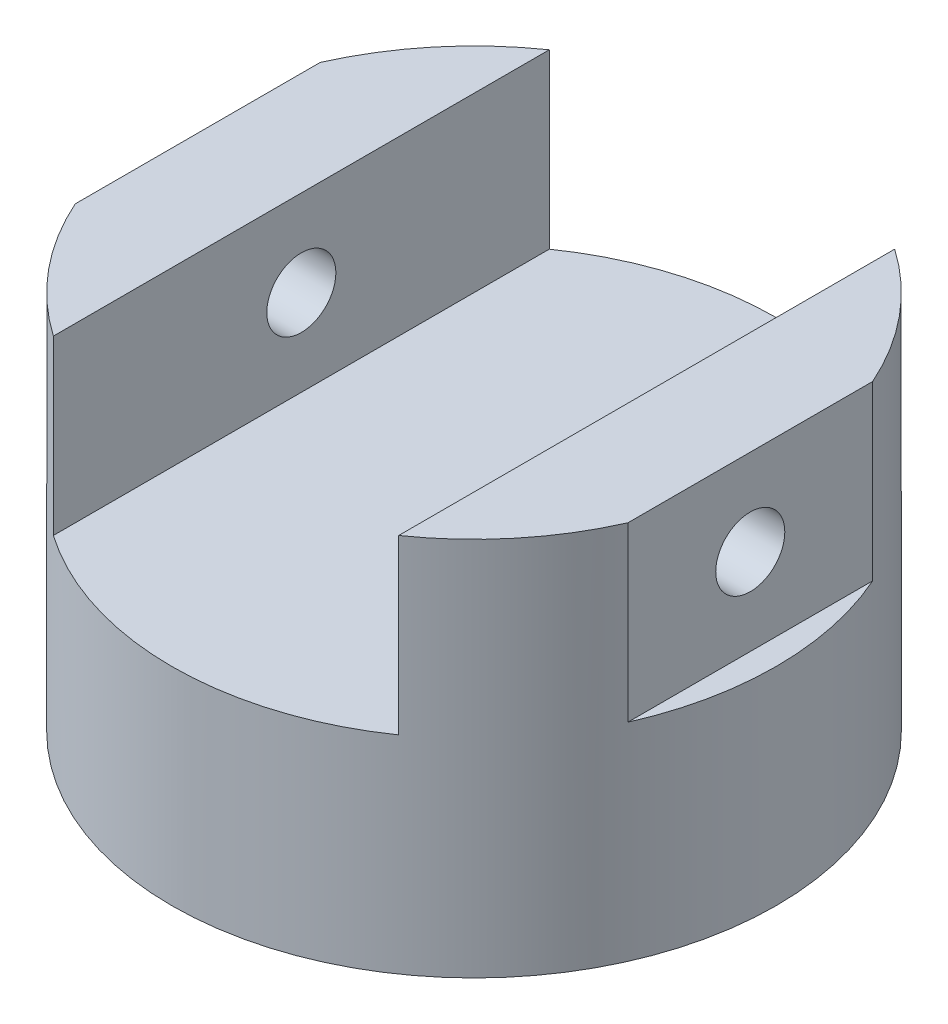
ISO-10303-21;
HEADER;
FILE_DESCRIPTION(('STEP AP214'),'2;1');
FILE_NAME('part.step','',(''),(''),'','','');
FILE_SCHEMA(('AUTOMOTIVE_DESIGN { 1 0 10303 214 1 1 1 1 }'));
ENDSEC;
DATA;
#1=APPLICATION_CONTEXT('core data for automotive mechanical design processes');
#2=APPLICATION_PROTOCOL_DEFINITION('international standard','automotive_design',2000,#1);
#3=PRODUCT_CONTEXT('',#1,'mechanical');
#4=PRODUCT('Part','Part','',(#3));
#5=PRODUCT_RELATED_PRODUCT_CATEGORY('part','',(#4));
#6=PRODUCT_DEFINITION_FORMATION('','',#4);
#7=PRODUCT_DEFINITION_CONTEXT('part definition',#1,'design');
#8=PRODUCT_DEFINITION('design','',#6,#7);
#9=PRODUCT_DEFINITION_SHAPE('','',#8);
#10=(LENGTH_UNIT() NAMED_UNIT(*) SI_UNIT(.MILLI.,.METRE.));
#11=(NAMED_UNIT(*) PLANE_ANGLE_UNIT() SI_UNIT($,.RADIAN.));
#12=(NAMED_UNIT(*) SI_UNIT($,.STERADIAN.) SOLID_ANGLE_UNIT());
#13=UNCERTAINTY_MEASURE_WITH_UNIT(LENGTH_MEASURE(1.E-05),#10,'distance_accuracy_value','');
#14=(GEOMETRIC_REPRESENTATION_CONTEXT(3) GLOBAL_UNCERTAINTY_ASSIGNED_CONTEXT((#13)) GLOBAL_UNIT_ASSIGNED_CONTEXT((#10,
#11,#12)) REPRESENTATION_CONTEXT('',''));
#15=CARTESIAN_POINT('',(0.,0.,0.));
#16=DIRECTION('',(0.,0.,1.));
#17=DIRECTION('',(1.,0.,0.));
#18=AXIS2_PLACEMENT_3D('',#15,#16,#17);
#19=CARTESIAN_POINT('',(0.,260.,0.));
#20=DIRECTION('',(0.,1.,0.));
#21=DIRECTION('',(0.,0.,1.));
#22=AXIS2_PLACEMENT_3D('',#19,#20,#21);
#23=PLANE('',#22);
#24=DIRECTION('',(0.,0.,1.));
#25=VECTOR('',#24,1.);
#26=CARTESIAN_POINT('',(160.,260.,-175.));
#27=LINE('',#26,#25);
#28=CARTESIAN_POINT('',(160.,260.,-70.887234393789));
#29=VERTEX_POINT('',#28);
#30=CARTESIAN_POINT('',(160.,260.,70.887234393789));
#31=VERTEX_POINT('',#30);
#32=EDGE_CURVE('E51',#29,#31,#27,.T.);
#33=ORIENTED_EDGE('',*,*,#32,.F.);
#34=CARTESIAN_POINT('',(0.,260.,0.));
#35=DIRECTION('',(0.,-1.,0.));
#36=DIRECTION('',(0.,0.,-1.));
#37=AXIS2_PLACEMENT_3D('',#34,#35,#36);
#38=CIRCLE('',#37,175.);
#39=CARTESIAN_POINT('',(100.,260.,-143.614066163451));
#40=VERTEX_POINT('',#39);
#41=EDGE_CURVE('E154',#40,#29,#38,.T.);
#42=ORIENTED_EDGE('',*,*,#41,.F.);
#43=DIRECTION('',(0.,0.,1.));
#44=VECTOR('',#43,1.);
#45=CARTESIAN_POINT('',(100.,260.,-175.));
#46=LINE('',#45,#44);
#47=CARTESIAN_POINT('',(100.,260.,143.614066163451));
#48=VERTEX_POINT('',#47);
#49=EDGE_CURVE('E131',#40,#48,#46,.T.);
#50=ORIENTED_EDGE('',*,*,#49,.T.);
#51=EDGE_CURVE('E153',#31,#48,#38,.T.);
#52=ORIENTED_EDGE('',*,*,#51,.F.);
#53=EDGE_LOOP('',(#33,#42,#50,#52));
#54=FACE_BOUND('',#53,.T.);
#55=ADVANCED_FACE('F35',(#54),#23,.T.);
#56=DIRECTION('',(0.,0.,1.));
#57=VECTOR('',#56,1.);
#58=CARTESIAN_POINT('',(-160.,260.,-175.));
#59=LINE('',#58,#57);
#60=CARTESIAN_POINT('',(-160.,260.,-70.887234393789));
#61=VERTEX_POINT('',#60);
#62=CARTESIAN_POINT('',(-160.,260.,70.887234393789));
#63=VERTEX_POINT('',#62);
#64=EDGE_CURVE('E117',#61,#63,#59,.T.);
#65=ORIENTED_EDGE('',*,*,#64,.T.);
#66=CARTESIAN_POINT('',(-100.,260.,143.614066163451));
#67=VERTEX_POINT('',#66);
#68=EDGE_CURVE('E151',#67,#63,#38,.T.);
#69=ORIENTED_EDGE('',*,*,#68,.F.);
#70=DIRECTION('',(0.,0.,1.));
#71=VECTOR('',#70,1.);
#72=CARTESIAN_POINT('',(-100.,260.,-175.));
#73=LINE('',#72,#71);
#74=CARTESIAN_POINT('',(-100.,260.,-143.614066163451));
#75=VERTEX_POINT('',#74);
#76=EDGE_CURVE('E59',#75,#67,#73,.T.);
#77=ORIENTED_EDGE('',*,*,#76,.F.);
#78=EDGE_CURVE('E150',#61,#75,#38,.T.);
#79=ORIENTED_EDGE('',*,*,#78,.F.);
#80=EDGE_LOOP('',(#65,#69,#77,#79));
#81=FACE_BOUND('',#80,.T.);
#82=ADVANCED_FACE('F37',(#81),#23,.T.);
#83=CARTESIAN_POINT('',(0.,0.,0.));
#84=DIRECTION('',(0.,-1.,0.));
#85=DIRECTION('',(0.,0.,-1.));
#86=AXIS2_PLACEMENT_3D('',#83,#84,#85);
#87=CYLINDRICAL_SURFACE('',#86,175.);
#88=DIRECTION('',(0.,-1.,0.));
#89=VECTOR('',#88,1.);
#90=CARTESIAN_POINT('',(-160.,0.,70.887234393789));
#91=LINE('',#90,#89);
#92=CARTESIAN_POINT('',(-160.,160.,70.8872343937892));
#93=VERTEX_POINT('',#92);
#94=EDGE_CURVE('E11',#93,#63,#91,.F.);
#95=ORIENTED_EDGE('',*,*,#94,.F.);
#96=CARTESIAN_POINT('',(0.,160.,0.));
#97=DIRECTION('',(0.,-1.,0.));
#98=DIRECTION('',(0.,0.,-1.));
#99=AXIS2_PLACEMENT_3D('',#96,#97,#98);
#100=CIRCLE('',#99,175.);
#101=CARTESIAN_POINT('',(-160.,160.,-70.8872343937892));
#102=VERTEX_POINT('',#101);
#103=EDGE_CURVE('E102',#102,#93,#100,.F.);
#104=ORIENTED_EDGE('',*,*,#103,.F.);
#105=DIRECTION('',(0.,-1.,0.));
#106=VECTOR('',#105,1.);
#107=CARTESIAN_POINT('',(-160.,0.,-70.887234393789));
#108=LINE('',#107,#106);
#109=EDGE_CURVE('E44',#61,#102,#108,.T.);
#110=ORIENTED_EDGE('',*,*,#109,.F.);
#111=ORIENTED_EDGE('',*,*,#78,.T.);
#112=DIRECTION('',(0.,-1.,0.));
#113=VECTOR('',#112,1.);
#114=CARTESIAN_POINT('',(-100.,0.,-143.614066163451));
#115=LINE('',#114,#113);
#116=CARTESIAN_POINT('',(-100.,160.,-143.614066163451));
#117=VERTEX_POINT('',#116);
#118=EDGE_CURVE('E165',#117,#75,#115,.F.);
#119=ORIENTED_EDGE('',*,*,#118,.F.);
#120=CARTESIAN_POINT('',(0.,160.,0.));
#121=DIRECTION('',(0.,-1.,0.));
#122=DIRECTION('',(0.,0.,-1.));
#123=AXIS2_PLACEMENT_3D('',#120,#121,#122);
#124=CIRCLE('',#123,175.);
#125=CARTESIAN_POINT('',(100.,160.,-143.614066163451));
#126=VERTEX_POINT('',#125);
#127=EDGE_CURVE('E158',#126,#117,#124,.F.);
#128=ORIENTED_EDGE('',*,*,#127,.F.);
#129=DIRECTION('',(0.,-1.,0.));
#130=VECTOR('',#129,1.);
#131=CARTESIAN_POINT('',(100.,0.,-143.614066163451));
#132=LINE('',#131,#130);
#133=EDGE_CURVE('E161',#40,#126,#132,.T.);
#134=ORIENTED_EDGE('',*,*,#133,.F.);
#135=ORIENTED_EDGE('',*,*,#41,.T.);
#136=DIRECTION('',(0.,-1.,0.));
#137=VECTOR('',#136,1.);
#138=CARTESIAN_POINT('',(160.,0.,-70.887234393789));
#139=LINE('',#138,#137);
#140=CARTESIAN_POINT('',(160.,160.,-70.887234393789));
#141=VERTEX_POINT('',#140);
#142=EDGE_CURVE('E111',#141,#29,#139,.F.);
#143=ORIENTED_EDGE('',*,*,#142,.F.);
#144=CARTESIAN_POINT('',(0.,160.,0.));
#145=DIRECTION('',(0.,-1.,0.));
#146=DIRECTION('',(0.,0.,-1.));
#147=AXIS2_PLACEMENT_3D('',#144,#145,#146);
#148=CIRCLE('',#147,175.);
#149=CARTESIAN_POINT('',(160.,160.,70.887234393789));
#150=VERTEX_POINT('',#149);
#151=EDGE_CURVE('E169',#150,#141,#148,.F.);
#152=ORIENTED_EDGE('',*,*,#151,.F.);
#153=DIRECTION('',(0.,-1.,0.));
#154=VECTOR('',#153,1.);
#155=CARTESIAN_POINT('',(160.,0.,70.887234393789));
#156=LINE('',#155,#154);
#157=EDGE_CURVE('E167',#31,#150,#156,.T.);
#158=ORIENTED_EDGE('',*,*,#157,.F.);
#159=ORIENTED_EDGE('',*,*,#51,.T.);
#160=DIRECTION('',(0.,-1.,0.));
#161=VECTOR('',#160,1.);
#162=CARTESIAN_POINT('',(100.,0.,143.614066163451));
#163=LINE('',#162,#161);
#164=CARTESIAN_POINT('',(100.,160.,143.614066163451));
#165=VERTEX_POINT('',#164);
#166=EDGE_CURVE('E157',#165,#48,#163,.F.);
#167=ORIENTED_EDGE('',*,*,#166,.F.);
#168=CARTESIAN_POINT('',(-100.,160.,143.614066163451));
#169=VERTEX_POINT('',#168);
#170=EDGE_CURVE('E155',#169,#165,#124,.F.);
#171=ORIENTED_EDGE('',*,*,#170,.F.);
#172=DIRECTION('',(0.,-1.,0.));
#173=VECTOR('',#172,1.);
#174=CARTESIAN_POINT('',(-100.,0.,143.614066163451));
#175=LINE('',#174,#173);
#176=EDGE_CURVE('E163',#67,#169,#175,.T.);
#177=ORIENTED_EDGE('',*,*,#176,.F.);
#178=ORIENTED_EDGE('',*,*,#68,.T.);
#179=EDGE_LOOP('',(#95,#104,#110,#111,#119,#128,#134,#135,#143,#152,#158,#159,#167,#171,#177,#178));
#180=FACE_BOUND('',#179,.T.);
#181=CARTESIAN_POINT('',(0.,40.,0.));
#182=DIRECTION('',(0.,-1.,0.));
#183=DIRECTION('',(0.,0.,-1.));
#184=AXIS2_PLACEMENT_3D('',#181,#182,#183);
#185=CIRCLE('',#184,175.);
#186=CARTESIAN_POINT('',(0.,40.,-175.));
#187=VERTEX_POINT('',#186);
#188=EDGE_CURVE('E147',#187,#187,#185,.T.);
#189=ORIENTED_EDGE('',*,*,#188,.F.);
#190=EDGE_LOOP('',(#189));
#191=FACE_BOUND('',#190,.T.);
#192=ADVANCED_FACE('F104',(#180,#191),#87,.T.);
#193=CARTESIAN_POINT('',(175.,40.,0.));
#194=DIRECTION('',(0.,-1.,0.));
#195=DIRECTION('',(0.,0.,-1.));
#196=AXIS2_PLACEMENT_3D('',#193,#194,#195);
#197=PLANE('',#196);
#198=ORIENTED_EDGE('',*,*,#188,.T.);
#199=EDGE_LOOP('',(#198));
#200=FACE_BOUND('',#199,.T.);
#201=CARTESIAN_POINT('',(0.,40.,0.));
#202=DIRECTION('',(0.,-1.,0.));
#203=DIRECTION('',(0.,0.,-1.));
#204=AXIS2_PLACEMENT_3D('',#201,#202,#203);
#205=CIRCLE('',#204,75.);
#206=CARTESIAN_POINT('',(0.,40.,-75.));
#207=VERTEX_POINT('',#206);
#208=EDGE_CURVE('E144',#207,#207,#205,.T.);
#209=ORIENTED_EDGE('',*,*,#208,.F.);
#210=EDGE_LOOP('',(#209));
#211=FACE_BOUND('',#210,.T.);
#212=ADVANCED_FACE('F212',(#200,#211),#197,.T.);
#213=CARTESIAN_POINT('',(0.,0.,0.));
#214=DIRECTION('',(0.,-1.,0.));
#215=DIRECTION('',(0.,0.,-1.));
#216=AXIS2_PLACEMENT_3D('',#213,#214,#215);
#217=CYLINDRICAL_SURFACE('',#216,75.);
#218=ORIENTED_EDGE('',*,*,#208,.T.);
#219=EDGE_LOOP('',(#218));
#220=FACE_BOUND('',#219,.T.);
#221=CARTESIAN_POINT('',(0.,0.,0.));
#222=DIRECTION('',(0.,-1.,0.));
#223=DIRECTION('',(0.,0.,-1.));
#224=AXIS2_PLACEMENT_3D('',#221,#222,#223);
#225=CIRCLE('',#224,75.);
#226=CARTESIAN_POINT('',(0.,0.,-75.));
#227=VERTEX_POINT('',#226);
#228=EDGE_CURVE('E134',#227,#227,#225,.T.);
#229=ORIENTED_EDGE('',*,*,#228,.F.);
#230=EDGE_LOOP('',(#229));
#231=FACE_BOUND('',#230,.T.);
#232=ADVANCED_FACE('F201',(#220,#231),#217,.T.);
#233=CARTESIAN_POINT('',(75.,0.,0.));
#234=DIRECTION('',(0.,-1.,0.));
#235=DIRECTION('',(0.,0.,-1.));
#236=AXIS2_PLACEMENT_3D('',#233,#234,#235);
#237=PLANE('',#236);
#238=ORIENTED_EDGE('',*,*,#228,.T.);
#239=EDGE_LOOP('',(#238));
#240=FACE_BOUND('',#239,.T.);
#241=ADVANCED_FACE('F193',(#240),#237,.T.);
#242=CARTESIAN_POINT('',(100.,260.,-175.));
#243=DIRECTION('',(1.,0.,0.));
#244=DIRECTION('',(0.,1.,0.));
#245=AXIS2_PLACEMENT_3D('',#242,#243,#244);
#246=PLANE('',#245);
#247=CARTESIAN_POINT('',(100.,210.,0.));
#248=DIRECTION('',(1.,0.,0.));
#249=DIRECTION('',(0.,1.,0.));
#250=AXIS2_PLACEMENT_3D('',#247,#248,#249);
#251=CIRCLE('',#250,20.);
#252=CARTESIAN_POINT('',(100.,230.,0.));
#253=VERTEX_POINT('',#252);
#254=EDGE_CURVE('E120',#253,#253,#251,.T.);
#255=ORIENTED_EDGE('',*,*,#254,.T.);
#256=EDGE_LOOP('',(#255));
#257=FACE_BOUND('',#256,.T.);
#258=ORIENTED_EDGE('',*,*,#166,.T.);
#259=ORIENTED_EDGE('',*,*,#49,.F.);
#260=ORIENTED_EDGE('',*,*,#133,.T.);
#261=DIRECTION('',(0.,0.,1.));
#262=VECTOR('',#261,1.);
#263=CARTESIAN_POINT('',(100.,160.,-175.));
#264=LINE('',#263,#262);
#265=EDGE_CURVE('E135',#126,#165,#264,.T.);
#266=ORIENTED_EDGE('',*,*,#265,.T.);
#267=EDGE_LOOP('',(#258,#259,#260,#266));
#268=FACE_BOUND('',#267,.T.);
#269=ADVANCED_FACE('F191',(#257,#268),#246,.F.);
#270=CARTESIAN_POINT('',(100.,160.,-175.));
#271=DIRECTION('',(0.,-1.,0.));
#272=DIRECTION('',(0.,0.,-1.));
#273=AXIS2_PLACEMENT_3D('',#270,#271,#272);
#274=PLANE('',#273);
#275=DIRECTION('',(0.,0.,1.));
#276=VECTOR('',#275,1.);
#277=CARTESIAN_POINT('',(-100.,160.,-175.));
#278=LINE('',#277,#276);
#279=EDGE_CURVE('E138',#117,#169,#278,.T.);
#280=ORIENTED_EDGE('',*,*,#279,.T.);
#281=ORIENTED_EDGE('',*,*,#170,.T.);
#282=ORIENTED_EDGE('',*,*,#265,.F.);
#283=ORIENTED_EDGE('',*,*,#127,.T.);
#284=EDGE_LOOP('',(#280,#281,#282,#283));
#285=FACE_BOUND('',#284,.T.);
#286=ADVANCED_FACE('F188',(#285),#274,.F.);
#287=CARTESIAN_POINT('',(-100.,260.,-175.));
#288=DIRECTION('',(-1.,0.,0.));
#289=DIRECTION('',(0.,-1.,0.));
#290=AXIS2_PLACEMENT_3D('',#287,#288,#289);
#291=PLANE('',#290);
#292=CARTESIAN_POINT('',(-100.,210.,0.));
#293=DIRECTION('',(-1.,0.,0.));
#294=DIRECTION('',(0.,-1.,0.));
#295=AXIS2_PLACEMENT_3D('',#292,#293,#294);
#296=CIRCLE('',#295,20.);
#297=CARTESIAN_POINT('',(-100.,190.,0.));
#298=VERTEX_POINT('',#297);
#299=EDGE_CURVE('E124',#298,#298,#296,.T.);
#300=ORIENTED_EDGE('',*,*,#299,.T.);
#301=EDGE_LOOP('',(#300));
#302=FACE_BOUND('',#301,.T.);
#303=ORIENTED_EDGE('',*,*,#118,.T.);
#304=ORIENTED_EDGE('',*,*,#76,.T.);
#305=ORIENTED_EDGE('',*,*,#176,.T.);
#306=ORIENTED_EDGE('',*,*,#279,.F.);
#307=EDGE_LOOP('',(#303,#304,#305,#306));
#308=FACE_BOUND('',#307,.T.);
#309=ADVANCED_FACE('F185',(#302,#308),#291,.F.);
#310=CARTESIAN_POINT('',(160.,160.,-175.));
#311=DIRECTION('',(0.,-1.,0.));
#312=DIRECTION('',(0.,0.,-1.));
#313=AXIS2_PLACEMENT_3D('',#310,#311,#312);
#314=PLANE('',#313);
#315=ORIENTED_EDGE('',*,*,#151,.T.);
#316=DIRECTION('',(0.,0.,1.));
#317=VECTOR('',#316,1.);
#318=CARTESIAN_POINT('',(160.,160.,-175.));
#319=LINE('',#318,#317);
#320=EDGE_CURVE('E127',#141,#150,#319,.T.);
#321=ORIENTED_EDGE('',*,*,#320,.T.);
#322=EDGE_LOOP('',(#315,#321));
#323=FACE_BOUND('',#322,.T.);
#324=ADVANCED_FACE('F223',(#323),#314,.F.);
#325=CARTESIAN_POINT('',(160.,260.,-175.));
#326=DIRECTION('',(-1.,0.,0.));
#327=DIRECTION('',(0.,-1.,0.));
#328=AXIS2_PLACEMENT_3D('',#325,#326,#327);
#329=PLANE('',#328);
#330=CARTESIAN_POINT('',(160.,210.,0.));
#331=DIRECTION('',(-1.,0.,0.));
#332=DIRECTION('',(0.,-1.,0.));
#333=AXIS2_PLACEMENT_3D('',#330,#331,#332);
#334=CIRCLE('',#333,20.);
#335=CARTESIAN_POINT('',(160.,190.,0.));
#336=VERTEX_POINT('',#335);
#337=EDGE_CURVE('E233',#336,#336,#334,.T.);
#338=ORIENTED_EDGE('',*,*,#337,.T.);
#339=EDGE_LOOP('',(#338));
#340=FACE_BOUND('',#339,.T.);
#341=ORIENTED_EDGE('',*,*,#142,.T.);
#342=ORIENTED_EDGE('',*,*,#32,.T.);
#343=ORIENTED_EDGE('',*,*,#157,.T.);
#344=ORIENTED_EDGE('',*,*,#320,.F.);
#345=EDGE_LOOP('',(#341,#342,#343,#344));
#346=FACE_BOUND('',#345,.T.);
#347=ADVANCED_FACE('F173',(#340,#346),#329,.F.);
#348=CARTESIAN_POINT('',(-160.,260.,-175.));
#349=DIRECTION('',(1.,0.,0.));
#350=DIRECTION('',(0.,1.,0.));
#351=AXIS2_PLACEMENT_3D('',#348,#349,#350);
#352=PLANE('',#351);
#353=CARTESIAN_POINT('',(-160.,210.,0.));
#354=DIRECTION('',(1.,0.,0.));
#355=DIRECTION('',(0.,1.,0.));
#356=AXIS2_PLACEMENT_3D('',#353,#354,#355);
#357=CIRCLE('',#356,20.);
#358=CARTESIAN_POINT('',(-160.,230.,0.));
#359=VERTEX_POINT('',#358);
#360=EDGE_CURVE('E39',#359,#359,#357,.T.);
#361=ORIENTED_EDGE('',*,*,#360,.T.);
#362=EDGE_LOOP('',(#361));
#363=FACE_BOUND('',#362,.T.);
#364=ORIENTED_EDGE('',*,*,#94,.T.);
#365=ORIENTED_EDGE('',*,*,#64,.F.);
#366=ORIENTED_EDGE('',*,*,#109,.T.);
#367=DIRECTION('',(0.,0.,1.));
#368=VECTOR('',#367,1.);
#369=CARTESIAN_POINT('',(-160.,160.,-175.));
#370=LINE('',#369,#368);
#371=EDGE_CURVE('E115',#102,#93,#370,.T.);
#372=ORIENTED_EDGE('',*,*,#371,.T.);
#373=EDGE_LOOP('',(#364,#365,#366,#372));
#374=FACE_BOUND('',#373,.T.);
#375=ADVANCED_FACE('F114',(#363,#374),#352,.F.);
#376=CARTESIAN_POINT('',(-160.,160.,-175.));
#377=DIRECTION('',(0.,-1.,0.));
#378=DIRECTION('',(0.,0.,-1.));
#379=AXIS2_PLACEMENT_3D('',#376,#377,#378);
#380=PLANE('',#379);
#381=ORIENTED_EDGE('',*,*,#371,.F.);
#382=ORIENTED_EDGE('',*,*,#103,.T.);
#383=EDGE_LOOP('',(#381,#382));
#384=FACE_BOUND('',#383,.T.);
#385=ADVANCED_FACE('F119',(#384),#380,.F.);
#386=CARTESIAN_POINT('',(-175.,210.,0.));
#387=DIRECTION('',(1.,0.,0.));
#388=DIRECTION('',(0.,1.,0.));
#389=AXIS2_PLACEMENT_3D('',#386,#387,#388);
#390=CYLINDRICAL_SURFACE('',#389,20.);
#391=ORIENTED_EDGE('',*,*,#360,.F.);
#392=EDGE_LOOP('',(#391));
#393=FACE_BOUND('',#392,.T.);
#394=ORIENTED_EDGE('',*,*,#299,.F.);
#395=EDGE_LOOP('',(#394));
#396=FACE_BOUND('',#395,.T.);
#397=ADVANCED_FACE('F243',(#393,#396),#390,.F.);
#398=ORIENTED_EDGE('',*,*,#337,.F.);
#399=EDGE_LOOP('',(#398));
#400=FACE_BOUND('',#399,.T.);
#401=ORIENTED_EDGE('',*,*,#254,.F.);
#402=EDGE_LOOP('',(#401));
#403=FACE_BOUND('',#402,.T.);
#404=ADVANCED_FACE('F245',(#400,#403),#390,.F.);
#405=CLOSED_SHELL('',(#55,#82,#192,#212,#232,#241,#269,#286,#309,#324,#347,#375,#385,#397,#404));
#406=MANIFOLD_SOLID_BREP('B2',#405);
#407=ADVANCED_BREP_SHAPE_REPRESENTATION('',(#18,#406),#14);
#408=SHAPE_DEFINITION_REPRESENTATION(#9,#407);
ENDSEC;
END-ISO-10303-21;
